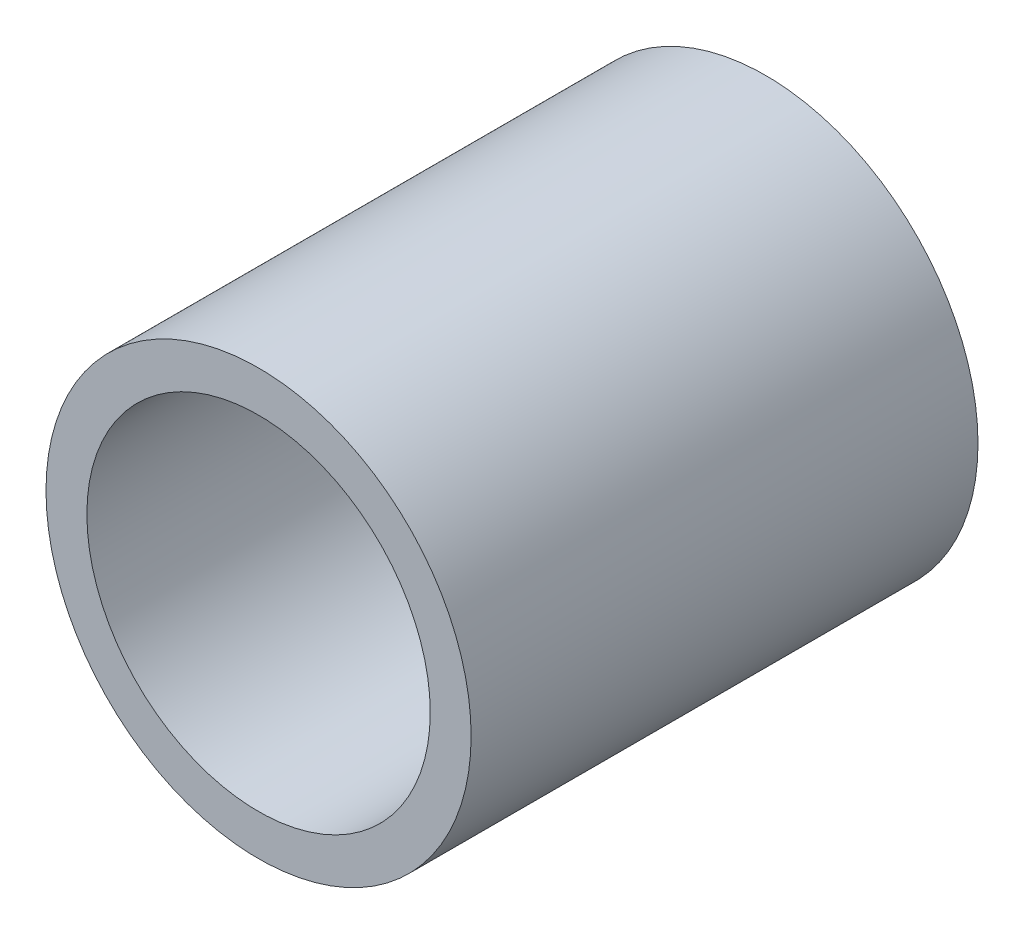
ISO-10303-21;
HEADER;
FILE_DESCRIPTION(('STEP AP214'),'2;1');
FILE_NAME('part.step','',(''),(''),'','','');
FILE_SCHEMA(('AUTOMOTIVE_DESIGN { 1 0 10303 214 1 1 1 1 }'));
ENDSEC;
DATA;
#1=APPLICATION_CONTEXT('core data for automotive mechanical design processes');
#2=APPLICATION_PROTOCOL_DEFINITION('international standard','automotive_design',2000,#1);
#3=PRODUCT_CONTEXT('',#1,'mechanical');
#4=PRODUCT('Part','Part','',(#3));
#5=PRODUCT_RELATED_PRODUCT_CATEGORY('part','',(#4));
#6=PRODUCT_DEFINITION_FORMATION('','',#4);
#7=PRODUCT_DEFINITION_CONTEXT('part definition',#1,'design');
#8=PRODUCT_DEFINITION('design','',#6,#7);
#9=PRODUCT_DEFINITION_SHAPE('','',#8);
#10=(LENGTH_UNIT() NAMED_UNIT(*) SI_UNIT(.MILLI.,.METRE.));
#11=(NAMED_UNIT(*) PLANE_ANGLE_UNIT() SI_UNIT($,.RADIAN.));
#12=(NAMED_UNIT(*) SI_UNIT($,.STERADIAN.) SOLID_ANGLE_UNIT());
#13=UNCERTAINTY_MEASURE_WITH_UNIT(LENGTH_MEASURE(1.E-05),#10,'distance_accuracy_value','');
#14=(GEOMETRIC_REPRESENTATION_CONTEXT(3) GLOBAL_UNCERTAINTY_ASSIGNED_CONTEXT((#13)) GLOBAL_UNIT_ASSIGNED_CONTEXT((#10,
#11,#12)) REPRESENTATION_CONTEXT('',''));
#15=CARTESIAN_POINT('',(0.,0.,0.));
#16=DIRECTION('',(0.,0.,1.));
#17=DIRECTION('',(1.,0.,0.));
#18=AXIS2_PLACEMENT_3D('',#15,#16,#17);
#19=CARTESIAN_POINT('',(606.622105948307,471.1394438,0.));
#20=DIRECTION('',(0.,0.,-1.));
#21=DIRECTION('',(-1.,0.,0.));
#22=AXIS2_PLACEMENT_3D('',#19,#20,#21);
#23=CYLINDRICAL_SURFACE('',#22,20.0023984001451);
#24=CARTESIAN_POINT('',(606.622105948307,471.1394438,59.055));
#25=DIRECTION('',(0.,0.,-1.));
#26=DIRECTION('',(-1.,0.,0.));
#27=AXIS2_PLACEMENT_3D('',#24,#25,#26);
#28=CIRCLE('',#27,20.0023984001451);
#29=CARTESIAN_POINT('',(586.619707548162,471.1394438,59.055));
#30=VERTEX_POINT('',#29);
#31=EDGE_CURVE('E26',#30,#30,#28,.T.);
#32=ORIENTED_EDGE('',*,*,#31,.F.);
#33=EDGE_LOOP('',(#32));
#34=FACE_BOUND('',#33,.T.);
#35=CARTESIAN_POINT('',(606.622105948307,471.1394438,0.));
#36=DIRECTION('',(0.,0.,-1.));
#37=DIRECTION('',(-1.,0.,0.));
#38=AXIS2_PLACEMENT_3D('',#35,#36,#37);
#39=CIRCLE('',#38,20.0023984001451);
#40=CARTESIAN_POINT('',(586.619707548162,471.1394438,0.));
#41=VERTEX_POINT('',#40);
#42=EDGE_CURVE('E17',#41,#41,#39,.T.);
#43=ORIENTED_EDGE('',*,*,#42,.T.);
#44=EDGE_LOOP('',(#43));
#45=FACE_BOUND('',#44,.T.);
#46=ADVANCED_FACE('F14',(#34,#45),#23,.F.);
#47=CARTESIAN_POINT('',(606.622156748307,471.1393676,0.));
#48=DIRECTION('',(0.,0.,1.));
#49=DIRECTION('',(1.,0.,0.));
#50=AXIS2_PLACEMENT_3D('',#47,#48,#49);
#51=PLANE('',#50);
#52=CARTESIAN_POINT('',(606.622156748307,471.1393676,0.));
#53=DIRECTION('',(0.,0.,-1.));
#54=DIRECTION('',(-1.,0.,0.));
#55=AXIS2_PLACEMENT_3D('',#52,#53,#54);
#56=CIRCLE('',#55,24.765);
#57=CARTESIAN_POINT('',(581.857156748307,471.1393676,0.));
#58=VERTEX_POINT('',#57);
#59=EDGE_CURVE('E21',#58,#58,#56,.F.);
#60=ORIENTED_EDGE('',*,*,#59,.F.);
#61=EDGE_LOOP('',(#60));
#62=FACE_BOUND('',#61,.T.);
#63=ORIENTED_EDGE('',*,*,#42,.F.);
#64=EDGE_LOOP('',(#63));
#65=FACE_BOUND('',#64,.T.);
#66=ADVANCED_FACE('F35',(#62,#65),#51,.F.);
#67=CARTESIAN_POINT('',(581.857156748307,471.1393676,59.055));
#68=DIRECTION('',(0.,0.,1.));
#69=DIRECTION('',(1.,0.,0.));
#70=AXIS2_PLACEMENT_3D('',#67,#68,#69);
#71=PLANE('',#70);
#72=ORIENTED_EDGE('',*,*,#31,.T.);
#73=EDGE_LOOP('',(#72));
#74=FACE_BOUND('',#73,.T.);
#75=CARTESIAN_POINT('',(606.622156748307,471.1393676,59.055));
#76=DIRECTION('',(0.,0.,-1.));
#77=DIRECTION('',(-1.,0.,0.));
#78=AXIS2_PLACEMENT_3D('',#75,#76,#77);
#79=CIRCLE('',#78,24.765);
#80=CARTESIAN_POINT('',(581.857156748307,471.1393676,59.055));
#81=VERTEX_POINT('',#80);
#82=EDGE_CURVE('E10',#81,#81,#79,.T.);
#83=ORIENTED_EDGE('',*,*,#82,.F.);
#84=EDGE_LOOP('',(#83));
#85=FACE_BOUND('',#84,.T.);
#86=ADVANCED_FACE('F37',(#74,#85),#71,.T.);
#87=CARTESIAN_POINT('',(606.622156748307,471.1393676,0.));
#88=DIRECTION('',(0.,0.,-1.));
#89=DIRECTION('',(-1.,0.,0.));
#90=AXIS2_PLACEMENT_3D('',#87,#88,#89);
#91=CYLINDRICAL_SURFACE('',#90,24.765);
#92=ORIENTED_EDGE('',*,*,#59,.T.);
#93=EDGE_LOOP('',(#92));
#94=FACE_BOUND('',#93,.T.);
#95=ORIENTED_EDGE('',*,*,#82,.T.);
#96=EDGE_LOOP('',(#95));
#97=FACE_BOUND('',#96,.T.);
#98=ADVANCED_FACE('F44',(#94,#97),#91,.T.);
#99=CLOSED_SHELL('',(#46,#66,#86,#98));
#100=MANIFOLD_SOLID_BREP('B1',#99);
#101=ADVANCED_BREP_SHAPE_REPRESENTATION('',(#18,#100),#14);
#102=SHAPE_DEFINITION_REPRESENTATION(#9,#101);
ENDSEC;
END-ISO-10303-21;
